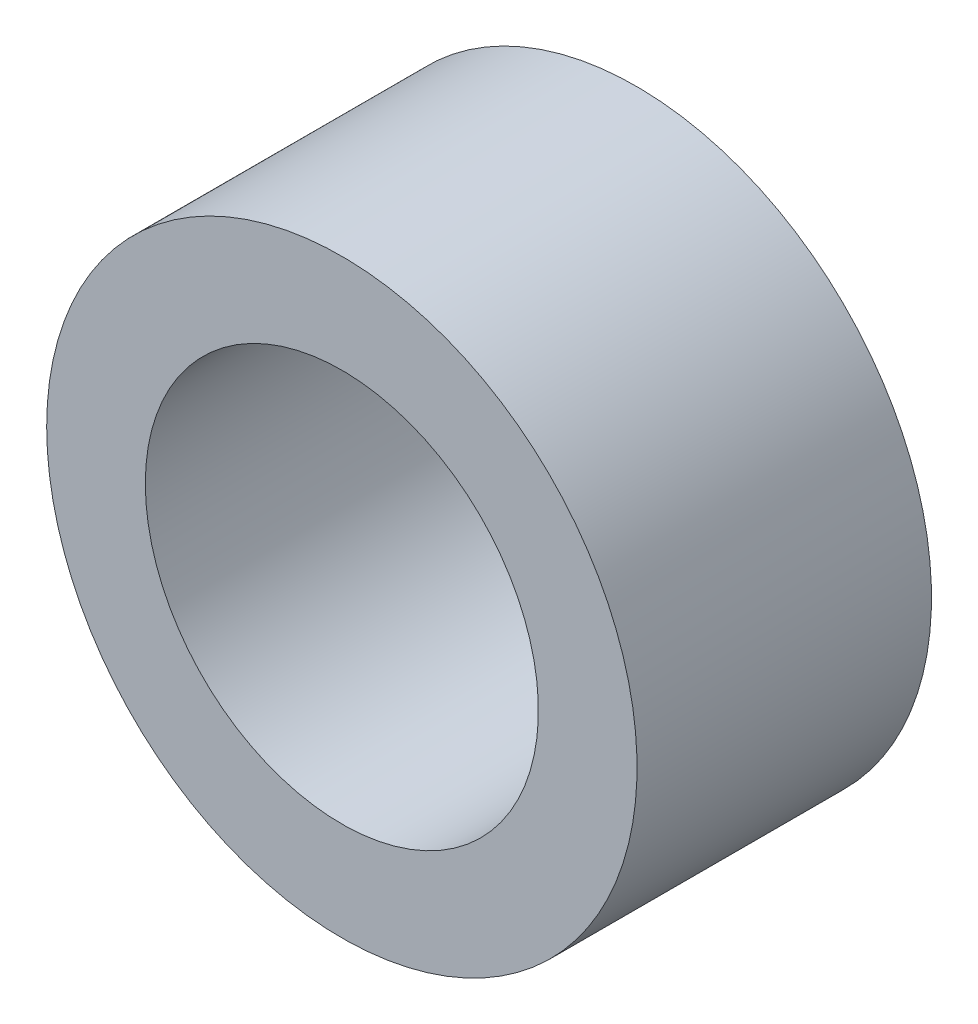
ISO-10303-21;
HEADER;
FILE_DESCRIPTION(('STEP AP214'),'2;1');
FILE_NAME('part.step','',(''),(''),'','','');
FILE_SCHEMA(('AUTOMOTIVE_DESIGN { 1 0 10303 214 1 1 1 1 }'));
ENDSEC;
DATA;
#1=APPLICATION_CONTEXT('core data for automotive mechanical design processes');
#2=APPLICATION_PROTOCOL_DEFINITION('international standard','automotive_design',2000,#1);
#3=PRODUCT_CONTEXT('',#1,'mechanical');
#4=PRODUCT('Part','Part','',(#3));
#5=PRODUCT_RELATED_PRODUCT_CATEGORY('part','',(#4));
#6=PRODUCT_DEFINITION_FORMATION('','',#4);
#7=PRODUCT_DEFINITION_CONTEXT('part definition',#1,'design');
#8=PRODUCT_DEFINITION('design','',#6,#7);
#9=PRODUCT_DEFINITION_SHAPE('','',#8);
#10=(LENGTH_UNIT() NAMED_UNIT(*) SI_UNIT(.MILLI.,.METRE.));
#11=(NAMED_UNIT(*) PLANE_ANGLE_UNIT() SI_UNIT($,.RADIAN.));
#12=(NAMED_UNIT(*) SI_UNIT($,.STERADIAN.) SOLID_ANGLE_UNIT());
#13=UNCERTAINTY_MEASURE_WITH_UNIT(LENGTH_MEASURE(1.E-05),#10,'distance_accuracy_value','');
#14=(GEOMETRIC_REPRESENTATION_CONTEXT(3) GLOBAL_UNCERTAINTY_ASSIGNED_CONTEXT((#13)) GLOBAL_UNIT_ASSIGNED_CONTEXT((#10,
#11,#12)) REPRESENTATION_CONTEXT('',''));
#15=CARTESIAN_POINT('',(0.,0.,0.));
#16=DIRECTION('',(0.,0.,1.));
#17=DIRECTION('',(1.,0.,0.));
#18=AXIS2_PLACEMENT_3D('',#15,#16,#17);
#19=CARTESIAN_POINT('',(0.,0.,3.));
#20=DIRECTION('',(0.,0.,-1.));
#21=DIRECTION('',(-1.,0.,0.));
#22=AXIS2_PLACEMENT_3D('',#19,#20,#21);
#23=CYLINDRICAL_SURFACE('',#22,4.005);
#24=CARTESIAN_POINT('',(0.,0.,-3.));
#25=DIRECTION('',(0.,0.,-1.));
#26=DIRECTION('',(-1.,0.,0.));
#27=AXIS2_PLACEMENT_3D('',#24,#25,#26);
#28=CIRCLE('',#27,4.005);
#29=CARTESIAN_POINT('',(-4.005,0.,-3.));
#30=VERTEX_POINT('',#29);
#31=EDGE_CURVE('E18',#30,#30,#28,.T.);
#32=ORIENTED_EDGE('',*,*,#31,.T.);
#33=EDGE_LOOP('',(#32));
#34=FACE_BOUND('',#33,.T.);
#35=CARTESIAN_POINT('',(0.,0.,3.));
#36=DIRECTION('',(0.,0.,-1.));
#37=DIRECTION('',(-1.,0.,0.));
#38=AXIS2_PLACEMENT_3D('',#35,#36,#37);
#39=CIRCLE('',#38,4.005);
#40=CARTESIAN_POINT('',(-4.005,0.,3.));
#41=VERTEX_POINT('',#40);
#42=EDGE_CURVE('E27',#41,#41,#39,.T.);
#43=ORIENTED_EDGE('',*,*,#42,.F.);
#44=EDGE_LOOP('',(#43));
#45=FACE_BOUND('',#44,.T.);
#46=ADVANCED_FACE('F15',(#34,#45),#23,.F.);
#47=CARTESIAN_POINT('',(0.,0.,-3.));
#48=DIRECTION('',(0.,0.,1.));
#49=DIRECTION('',(1.,0.,0.));
#50=AXIS2_PLACEMENT_3D('',#47,#48,#49);
#51=PLANE('',#50);
#52=ORIENTED_EDGE('',*,*,#31,.F.);
#53=EDGE_LOOP('',(#52));
#54=FACE_BOUND('',#53,.T.);
#55=CARTESIAN_POINT('',(0.,0.,-3.));
#56=DIRECTION('',(0.,0.,-1.));
#57=DIRECTION('',(-1.,0.,0.));
#58=AXIS2_PLACEMENT_3D('',#55,#56,#57);
#59=CIRCLE('',#58,6.015);
#60=CARTESIAN_POINT('',(-6.015,0.,-3.));
#61=VERTEX_POINT('',#60);
#62=EDGE_CURVE('E22',#61,#61,#59,.F.);
#63=ORIENTED_EDGE('',*,*,#62,.F.);
#64=EDGE_LOOP('',(#63));
#65=FACE_BOUND('',#64,.T.);
#66=ADVANCED_FACE('F37',(#54,#65),#51,.F.);
#67=CARTESIAN_POINT('',(0.,0.,3.));
#68=DIRECTION('',(0.,0.,1.));
#69=DIRECTION('',(1.,0.,0.));
#70=AXIS2_PLACEMENT_3D('',#67,#68,#69);
#71=PLANE('',#70);
#72=ORIENTED_EDGE('',*,*,#42,.T.);
#73=EDGE_LOOP('',(#72));
#74=FACE_BOUND('',#73,.T.);
#75=CARTESIAN_POINT('',(0.,0.,3.));
#76=DIRECTION('',(0.,0.,-1.));
#77=DIRECTION('',(-1.,0.,0.));
#78=AXIS2_PLACEMENT_3D('',#75,#76,#77);
#79=CIRCLE('',#78,6.015);
#80=CARTESIAN_POINT('',(-6.015,0.,3.));
#81=VERTEX_POINT('',#80);
#82=EDGE_CURVE('E10',#81,#81,#79,.T.);
#83=ORIENTED_EDGE('',*,*,#82,.F.);
#84=EDGE_LOOP('',(#83));
#85=FACE_BOUND('',#84,.T.);
#86=ADVANCED_FACE('F40',(#74,#85),#71,.T.);
#87=CARTESIAN_POINT('',(0.,0.,3.));
#88=DIRECTION('',(0.,0.,-1.));
#89=DIRECTION('',(-1.,0.,0.));
#90=AXIS2_PLACEMENT_3D('',#87,#88,#89);
#91=CYLINDRICAL_SURFACE('',#90,6.015);
#92=ORIENTED_EDGE('',*,*,#82,.T.);
#93=EDGE_LOOP('',(#92));
#94=FACE_BOUND('',#93,.T.);
#95=ORIENTED_EDGE('',*,*,#62,.T.);
#96=EDGE_LOOP('',(#95));
#97=FACE_BOUND('',#96,.T.);
#98=ADVANCED_FACE('F43',(#94,#97),#91,.T.);
#99=CLOSED_SHELL('',(#46,#66,#86,#98));
#100=MANIFOLD_SOLID_BREP('B1',#99);
#101=ADVANCED_BREP_SHAPE_REPRESENTATION('',(#18,#100),#14);
#102=SHAPE_DEFINITION_REPRESENTATION(#9,#101);
ENDSEC;
END-ISO-10303-21;
